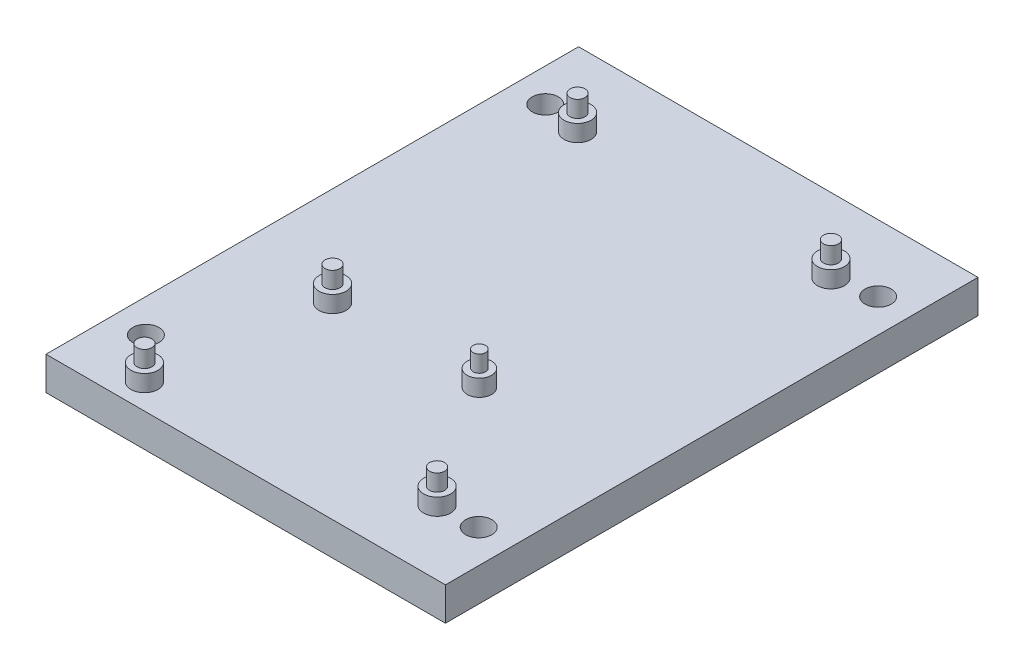
ISO-10303-21;
HEADER;
FILE_DESCRIPTION(('STEP AP214'),'2;1');
FILE_NAME('part.step','',(''),(''),'','','');
FILE_SCHEMA(('AUTOMOTIVE_DESIGN { 1 0 10303 214 1 1 1 1 }'));
ENDSEC;
DATA;
#1=APPLICATION_CONTEXT('core data for automotive mechanical design processes');
#2=APPLICATION_PROTOCOL_DEFINITION('international standard','automotive_design',2000,#1);
#3=PRODUCT_CONTEXT('',#1,'mechanical');
#4=PRODUCT('Part','Part','',(#3));
#5=PRODUCT_RELATED_PRODUCT_CATEGORY('part','',(#4));
#6=PRODUCT_DEFINITION_FORMATION('','',#4);
#7=PRODUCT_DEFINITION_CONTEXT('part definition',#1,'design');
#8=PRODUCT_DEFINITION('design','',#6,#7);
#9=PRODUCT_DEFINITION_SHAPE('','',#8);
#10=(LENGTH_UNIT() NAMED_UNIT(*) SI_UNIT(.MILLI.,.METRE.));
#11=(NAMED_UNIT(*) PLANE_ANGLE_UNIT() SI_UNIT($,.RADIAN.));
#12=(NAMED_UNIT(*) SI_UNIT($,.STERADIAN.) SOLID_ANGLE_UNIT());
#13=UNCERTAINTY_MEASURE_WITH_UNIT(LENGTH_MEASURE(1.E-05),#10,'distance_accuracy_value','');
#14=(GEOMETRIC_REPRESENTATION_CONTEXT(3) GLOBAL_UNCERTAINTY_ASSIGNED_CONTEXT((#13)) GLOBAL_UNIT_ASSIGNED_CONTEXT((#10,
#11,#12)) REPRESENTATION_CONTEXT('',''));
#15=CARTESIAN_POINT('',(0.,0.,0.));
#16=DIRECTION('',(0.,0.,1.));
#17=DIRECTION('',(1.,0.,0.));
#18=AXIS2_PLACEMENT_3D('',#15,#16,#17);
#19=CARTESIAN_POINT('',(0.,6.35,0.));
#20=DIRECTION('',(0.,-1.,0.));
#21=DIRECTION('',(0.,0.,-1.));
#22=AXIS2_PLACEMENT_3D('',#19,#20,#21);
#23=PLANE('',#22);
#24=CARTESIAN_POINT('',(24.1681,6.35,38.4556));
#25=DIRECTION('',(0.,-1.,0.));
#26=DIRECTION('',(0.,0.,-1.));
#27=AXIS2_PLACEMENT_3D('',#24,#25,#26);
#28=CIRCLE('',#27,2.5781);
#29=CARTESIAN_POINT('',(24.1681,6.35,35.8775));
#30=VERTEX_POINT('',#29);
#31=EDGE_CURVE('E46',#30,#30,#28,.F.);
#32=ORIENTED_EDGE('',*,*,#31,.F.);
#33=EDGE_LOOP('',(#32));
#34=FACE_BOUND('',#33,.T.);
#35=CARTESIAN_POINT('',(-24.1681,6.35,45.9486));
#36=DIRECTION('',(0.,-1.,0.));
#37=DIRECTION('',(0.,0.,-1.));
#38=AXIS2_PLACEMENT_3D('',#35,#36,#37);
#39=CIRCLE('',#38,2.5781);
#40=CARTESIAN_POINT('',(-24.1681,6.35,43.3705));
#41=VERTEX_POINT('',#40);
#42=EDGE_CURVE('E133',#41,#41,#39,.F.);
#43=ORIENTED_EDGE('',*,*,#42,.F.);
#44=EDGE_LOOP('',(#43));
#45=FACE_BOUND('',#44,.T.);
#46=CARTESIAN_POINT('',(8.72659276633327,6.35,14.9479));
#47=DIRECTION('',(0.,-1.,0.));
#48=DIRECTION('',(0.,0.,-1.));
#49=AXIS2_PLACEMENT_3D('',#46,#47,#48);
#50=CIRCLE('',#49,2.33125636337754);
#51=CARTESIAN_POINT('',(8.72659276633327,6.35,12.6166436366225));
#52=VERTEX_POINT('',#51);
#53=EDGE_CURVE('E131',#52,#52,#50,.F.);
#54=ORIENTED_EDGE('',*,*,#53,.F.);
#55=EDGE_LOOP('',(#54));
#56=FACE_BOUND('',#55,.T.);
#57=CARTESIAN_POINT('',(-19.2896072336667,6.35,14.9479));
#58=DIRECTION('',(0.,-1.,0.));
#59=DIRECTION('',(0.,0.,-1.));
#60=AXIS2_PLACEMENT_3D('',#57,#58,#59);
#61=CIRCLE('',#60,2.5781);
#62=CARTESIAN_POINT('',(-19.2896072336667,6.35,12.3698));
#63=VERTEX_POINT('',#62);
#64=EDGE_CURVE('E128',#63,#63,#61,.F.);
#65=ORIENTED_EDGE('',*,*,#64,.F.);
#66=EDGE_LOOP('',(#65));
#67=FACE_BOUND('',#66,.T.);
#68=CARTESIAN_POINT('',(24.1681,6.35,-36.6776));
#69=DIRECTION('',(0.,-1.,0.));
#70=DIRECTION('',(0.,0.,-1.));
#71=AXIS2_PLACEMENT_3D('',#68,#69,#70);
#72=CIRCLE('',#71,2.5781);
#73=CARTESIAN_POINT('',(24.1681,6.35,-39.2557));
#74=VERTEX_POINT('',#73);
#75=EDGE_CURVE('E125',#74,#74,#72,.F.);
#76=ORIENTED_EDGE('',*,*,#75,.F.);
#77=EDGE_LOOP('',(#76));
#78=FACE_BOUND('',#77,.T.);
#79=CARTESIAN_POINT('',(-24.1681,6.35,-36.6776));
#80=DIRECTION('',(0.,-1.,0.));
#81=DIRECTION('',(0.,0.,-1.));
#82=AXIS2_PLACEMENT_3D('',#79,#80,#81);
#83=CIRCLE('',#82,2.5781);
#84=CARTESIAN_POINT('',(-24.1681,6.35,-39.2557));
#85=VERTEX_POINT('',#84);
#86=EDGE_CURVE('E122',#85,#85,#83,.F.);
#87=ORIENTED_EDGE('',*,*,#86,.F.);
#88=EDGE_LOOP('',(#87));
#89=FACE_BOUND('',#88,.T.);
#90=DIRECTION('',(0.,0.,-1.));
#91=VECTOR('',#90,1.);
#92=CARTESIAN_POINT('',(38.1,6.35,50.8));
#93=LINE('',#92,#91);
#94=CARTESIAN_POINT('',(38.1,6.35,50.8));
#95=VERTEX_POINT('',#94);
#96=CARTESIAN_POINT('',(38.1,6.35,-50.8));
#97=VERTEX_POINT('',#96);
#98=EDGE_CURVE('E97',#95,#97,#93,.T.);
#99=ORIENTED_EDGE('',*,*,#98,.T.);
#100=DIRECTION('',(-1.,0.,0.));
#101=VECTOR('',#100,1.);
#102=CARTESIAN_POINT('',(-38.1,6.35,-50.8));
#103=LINE('',#102,#101);
#104=CARTESIAN_POINT('',(-38.1,6.35,-50.8));
#105=VERTEX_POINT('',#104);
#106=EDGE_CURVE('E92',#97,#105,#103,.T.);
#107=ORIENTED_EDGE('',*,*,#106,.T.);
#108=DIRECTION('',(0.,0.,1.));
#109=VECTOR('',#108,1.);
#110=CARTESIAN_POINT('',(-38.1,6.35,50.8));
#111=LINE('',#110,#109);
#112=CARTESIAN_POINT('',(-38.1,6.35,50.8));
#113=VERTEX_POINT('',#112);
#114=EDGE_CURVE('E95',#105,#113,#111,.T.);
#115=ORIENTED_EDGE('',*,*,#114,.T.);
#116=DIRECTION('',(1.,0.,0.));
#117=VECTOR('',#116,1.);
#118=CARTESIAN_POINT('',(-38.1,6.35,50.8));
#119=LINE('',#118,#117);
#120=EDGE_CURVE('E61',#113,#95,#119,.T.);
#121=ORIENTED_EDGE('',*,*,#120,.T.);
#122=EDGE_LOOP('',(#99,#107,#115,#121));
#123=FACE_BOUND('',#122,.T.);
#124=CARTESIAN_POINT('',(-31.75,6.35,-38.1));
#125=DIRECTION('',(0.,1.,0.));
#126=DIRECTION('',(0.,0.,1.));
#127=AXIS2_PLACEMENT_3D('',#124,#125,#126);
#128=CIRCLE('',#127,2.5);
#129=CARTESIAN_POINT('',(-31.75,6.35,-35.6));
#130=VERTEX_POINT('',#129);
#131=EDGE_CURVE('E115',#130,#130,#128,.T.);
#132=ORIENTED_EDGE('',*,*,#131,.F.);
#133=EDGE_LOOP('',(#132));
#134=FACE_BOUND('',#133,.T.);
#135=CARTESIAN_POINT('',(-31.75,6.35,38.1));
#136=DIRECTION('',(0.,1.,0.));
#137=DIRECTION('',(0.,0.,1.));
#138=AXIS2_PLACEMENT_3D('',#135,#136,#137);
#139=CIRCLE('',#138,2.5);
#140=CARTESIAN_POINT('',(-31.75,6.35,40.6));
#141=VERTEX_POINT('',#140);
#142=EDGE_CURVE('E183',#141,#141,#139,.T.);
#143=ORIENTED_EDGE('',*,*,#142,.F.);
#144=EDGE_LOOP('',(#143));
#145=FACE_BOUND('',#144,.T.);
#146=CARTESIAN_POINT('',(31.75,6.35,-38.1));
#147=DIRECTION('',(0.,1.,0.));
#148=DIRECTION('',(0.,0.,1.));
#149=AXIS2_PLACEMENT_3D('',#146,#147,#148);
#150=CIRCLE('',#149,2.5);
#151=CARTESIAN_POINT('',(31.75,6.35,-35.6));
#152=VERTEX_POINT('',#151);
#153=EDGE_CURVE('E177',#152,#152,#150,.T.);
#154=ORIENTED_EDGE('',*,*,#153,.F.);
#155=EDGE_LOOP('',(#154));
#156=FACE_BOUND('',#155,.T.);
#157=CARTESIAN_POINT('',(31.75,6.35,38.1));
#158=DIRECTION('',(0.,1.,0.));
#159=DIRECTION('',(0.,0.,1.));
#160=AXIS2_PLACEMENT_3D('',#157,#158,#159);
#161=CIRCLE('',#160,2.5);
#162=CARTESIAN_POINT('',(31.75,6.35,40.6));
#163=VERTEX_POINT('',#162);
#164=EDGE_CURVE('E171',#163,#163,#161,.T.);
#165=ORIENTED_EDGE('',*,*,#164,.F.);
#166=EDGE_LOOP('',(#165));
#167=FACE_BOUND('',#166,.T.);
#168=ADVANCED_FACE('F42',(#34,#45,#56,#67,#78,#89,#123,#134,#145,#156,#167),#23,.F.);
#169=CARTESIAN_POINT('',(0.,0.,0.));
#170=DIRECTION('',(0.,-1.,0.));
#171=DIRECTION('',(0.,0.,-1.));
#172=AXIS2_PLACEMENT_3D('',#169,#170,#171);
#173=PLANE('',#172);
#174=CARTESIAN_POINT('',(31.75,0.,-38.1));
#175=DIRECTION('',(0.,1.,0.));
#176=DIRECTION('',(0.,0.,1.));
#177=AXIS2_PLACEMENT_3D('',#174,#175,#176);
#178=CIRCLE('',#177,2.5);
#179=CARTESIAN_POINT('',(31.75,0.,-35.6));
#180=VERTEX_POINT('',#179);
#181=EDGE_CURVE('E174',#180,#180,#178,.T.);
#182=ORIENTED_EDGE('',*,*,#181,.T.);
#183=EDGE_LOOP('',(#182));
#184=FACE_BOUND('',#183,.T.);
#185=CARTESIAN_POINT('',(-31.75,0.,-38.1));
#186=DIRECTION('',(0.,1.,0.));
#187=DIRECTION('',(0.,0.,1.));
#188=AXIS2_PLACEMENT_3D('',#185,#186,#187);
#189=CIRCLE('',#188,2.5);
#190=CARTESIAN_POINT('',(-31.75,0.,-35.6));
#191=VERTEX_POINT('',#190);
#192=EDGE_CURVE('E186',#191,#191,#189,.T.);
#193=ORIENTED_EDGE('',*,*,#192,.T.);
#194=EDGE_LOOP('',(#193));
#195=FACE_BOUND('',#194,.T.);
#196=DIRECTION('',(0.,0.,-1.));
#197=VECTOR('',#196,1.);
#198=CARTESIAN_POINT('',(38.1,0.,50.8));
#199=LINE('',#198,#197);
#200=CARTESIAN_POINT('',(38.1,0.,50.8));
#201=VERTEX_POINT('',#200);
#202=CARTESIAN_POINT('',(38.1,0.,-50.8));
#203=VERTEX_POINT('',#202);
#204=EDGE_CURVE('E112',#201,#203,#199,.T.);
#205=ORIENTED_EDGE('',*,*,#204,.F.);
#206=DIRECTION('',(1.,0.,0.));
#207=VECTOR('',#206,1.);
#208=CARTESIAN_POINT('',(-38.1,0.,50.8));
#209=LINE('',#208,#207);
#210=CARTESIAN_POINT('',(-38.1,0.,50.8));
#211=VERTEX_POINT('',#210);
#212=EDGE_CURVE('E84',#211,#201,#209,.T.);
#213=ORIENTED_EDGE('',*,*,#212,.F.);
#214=DIRECTION('',(0.,0.,1.));
#215=VECTOR('',#214,1.);
#216=CARTESIAN_POINT('',(-38.1,0.,50.8));
#217=LINE('',#216,#215);
#218=CARTESIAN_POINT('',(-38.1,0.,-50.8));
#219=VERTEX_POINT('',#218);
#220=EDGE_CURVE('E78',#219,#211,#217,.T.);
#221=ORIENTED_EDGE('',*,*,#220,.F.);
#222=DIRECTION('',(-1.,0.,0.));
#223=VECTOR('',#222,1.);
#224=CARTESIAN_POINT('',(-38.1,0.,-50.8));
#225=LINE('',#224,#223);
#226=EDGE_CURVE('E102',#203,#219,#225,.T.);
#227=ORIENTED_EDGE('',*,*,#226,.F.);
#228=EDGE_LOOP('',(#205,#213,#221,#227));
#229=FACE_BOUND('',#228,.T.);
#230=CARTESIAN_POINT('',(-31.75,0.,38.1));
#231=DIRECTION('',(0.,1.,0.));
#232=DIRECTION('',(0.,0.,1.));
#233=AXIS2_PLACEMENT_3D('',#230,#231,#232);
#234=CIRCLE('',#233,2.5);
#235=CARTESIAN_POINT('',(-31.75,0.,40.6));
#236=VERTEX_POINT('',#235);
#237=EDGE_CURVE('E180',#236,#236,#234,.T.);
#238=ORIENTED_EDGE('',*,*,#237,.T.);
#239=EDGE_LOOP('',(#238));
#240=FACE_BOUND('',#239,.T.);
#241=CARTESIAN_POINT('',(31.75,0.,38.1));
#242=DIRECTION('',(0.,1.,0.));
#243=DIRECTION('',(0.,0.,1.));
#244=AXIS2_PLACEMENT_3D('',#241,#242,#243);
#245=CIRCLE('',#244,2.5);
#246=CARTESIAN_POINT('',(31.75,0.,40.6));
#247=VERTEX_POINT('',#246);
#248=EDGE_CURVE('E170',#247,#247,#245,.T.);
#249=ORIENTED_EDGE('',*,*,#248,.T.);
#250=EDGE_LOOP('',(#249));
#251=FACE_BOUND('',#250,.T.);
#252=ADVANCED_FACE('F194',(#184,#195,#229,#240,#251),#173,.T.);
#253=CARTESIAN_POINT('',(38.1,6.35,50.8));
#254=DIRECTION('',(-1.,0.,0.));
#255=DIRECTION('',(0.,0.,1.));
#256=AXIS2_PLACEMENT_3D('',#253,#254,#255);
#257=PLANE('',#256);
#258=ORIENTED_EDGE('',*,*,#204,.T.);
#259=DIRECTION('',(0.,-1.,0.));
#260=VECTOR('',#259,1.);
#261=CARTESIAN_POINT('',(38.1,6.35,-50.8));
#262=LINE('',#261,#260);
#263=EDGE_CURVE('E103',#97,#203,#262,.T.);
#264=ORIENTED_EDGE('',*,*,#263,.F.);
#265=ORIENTED_EDGE('',*,*,#98,.F.);
#266=DIRECTION('',(0.,-1.,0.));
#267=VECTOR('',#266,1.);
#268=CARTESIAN_POINT('',(38.1,6.35,50.8));
#269=LINE('',#268,#267);
#270=EDGE_CURVE('E108',#95,#201,#269,.T.);
#271=ORIENTED_EDGE('',*,*,#270,.T.);
#272=EDGE_LOOP('',(#258,#264,#265,#271));
#273=FACE_BOUND('',#272,.T.);
#274=ADVANCED_FACE('F44',(#273),#257,.F.);
#275=CARTESIAN_POINT('',(-38.1,6.35,-50.8));
#276=DIRECTION('',(0.,0.,1.));
#277=DIRECTION('',(1.,0.,0.));
#278=AXIS2_PLACEMENT_3D('',#275,#276,#277);
#279=PLANE('',#278);
#280=ORIENTED_EDGE('',*,*,#226,.T.);
#281=DIRECTION('',(0.,-1.,0.));
#282=VECTOR('',#281,1.);
#283=CARTESIAN_POINT('',(-38.1,6.35,-50.8));
#284=LINE('',#283,#282);
#285=EDGE_CURVE('E100',#105,#219,#284,.T.);
#286=ORIENTED_EDGE('',*,*,#285,.F.);
#287=ORIENTED_EDGE('',*,*,#106,.F.);
#288=ORIENTED_EDGE('',*,*,#263,.T.);
#289=EDGE_LOOP('',(#280,#286,#287,#288));
#290=FACE_BOUND('',#289,.T.);
#291=ADVANCED_FACE('F101',(#290),#279,.F.);
#292=CARTESIAN_POINT('',(-38.1,6.35,50.8));
#293=DIRECTION('',(1.,0.,0.));
#294=DIRECTION('',(0.,0.,-1.));
#295=AXIS2_PLACEMENT_3D('',#292,#293,#294);
#296=PLANE('',#295);
#297=ORIENTED_EDGE('',*,*,#220,.T.);
#298=DIRECTION('',(0.,-1.,0.));
#299=VECTOR('',#298,1.);
#300=CARTESIAN_POINT('',(-38.1,6.35,50.8));
#301=LINE('',#300,#299);
#302=EDGE_CURVE('E104',#113,#211,#301,.T.);
#303=ORIENTED_EDGE('',*,*,#302,.F.);
#304=ORIENTED_EDGE('',*,*,#114,.F.);
#305=ORIENTED_EDGE('',*,*,#285,.T.);
#306=EDGE_LOOP('',(#297,#303,#304,#305));
#307=FACE_BOUND('',#306,.T.);
#308=ADVANCED_FACE('F106',(#307),#296,.F.);
#309=CARTESIAN_POINT('',(-38.1,6.35,50.8));
#310=DIRECTION('',(0.,0.,-1.));
#311=DIRECTION('',(-1.,0.,0.));
#312=AXIS2_PLACEMENT_3D('',#309,#310,#311);
#313=PLANE('',#312);
#314=ORIENTED_EDGE('',*,*,#212,.T.);
#315=ORIENTED_EDGE('',*,*,#270,.F.);
#316=ORIENTED_EDGE('',*,*,#120,.F.);
#317=ORIENTED_EDGE('',*,*,#302,.T.);
#318=EDGE_LOOP('',(#314,#315,#316,#317));
#319=FACE_BOUND('',#318,.T.);
#320=ADVANCED_FACE('F200',(#319),#313,.F.);
#321=CARTESIAN_POINT('',(-31.75,6.35,-38.1));
#322=DIRECTION('',(0.,-1.,0.));
#323=DIRECTION('',(0.,0.,-1.));
#324=AXIS2_PLACEMENT_3D('',#321,#322,#323);
#325=CYLINDRICAL_SURFACE('',#324,2.5);
#326=ORIENTED_EDGE('',*,*,#131,.T.);
#327=EDGE_LOOP('',(#326));
#328=FACE_BOUND('',#327,.T.);
#329=ORIENTED_EDGE('',*,*,#192,.F.);
#330=EDGE_LOOP('',(#329));
#331=FACE_BOUND('',#330,.T.);
#332=ADVANCED_FACE('F197',(#328,#331),#325,.F.);
#333=CARTESIAN_POINT('',(-31.75,6.35,38.1));
#334=DIRECTION('',(0.,-1.,0.));
#335=DIRECTION('',(0.,0.,-1.));
#336=AXIS2_PLACEMENT_3D('',#333,#334,#335);
#337=CYLINDRICAL_SURFACE('',#336,2.5);
#338=ORIENTED_EDGE('',*,*,#142,.T.);
#339=EDGE_LOOP('',(#338));
#340=FACE_BOUND('',#339,.T.);
#341=ORIENTED_EDGE('',*,*,#237,.F.);
#342=EDGE_LOOP('',(#341));
#343=FACE_BOUND('',#342,.T.);
#344=ADVANCED_FACE('F199',(#340,#343),#337,.F.);
#345=CARTESIAN_POINT('',(31.75,6.35,-38.1));
#346=DIRECTION('',(0.,-1.,0.));
#347=DIRECTION('',(0.,0.,-1.));
#348=AXIS2_PLACEMENT_3D('',#345,#346,#347);
#349=CYLINDRICAL_SURFACE('',#348,2.5);
#350=ORIENTED_EDGE('',*,*,#153,.T.);
#351=EDGE_LOOP('',(#350));
#352=FACE_BOUND('',#351,.T.);
#353=ORIENTED_EDGE('',*,*,#181,.F.);
#354=EDGE_LOOP('',(#353));
#355=FACE_BOUND('',#354,.T.);
#356=ADVANCED_FACE('F207',(#352,#355),#349,.F.);
#357=CARTESIAN_POINT('',(31.75,6.35,38.1));
#358=DIRECTION('',(0.,-1.,0.));
#359=DIRECTION('',(0.,0.,-1.));
#360=AXIS2_PLACEMENT_3D('',#357,#358,#359);
#361=CYLINDRICAL_SURFACE('',#360,2.5);
#362=ORIENTED_EDGE('',*,*,#164,.T.);
#363=EDGE_LOOP('',(#362));
#364=FACE_BOUND('',#363,.T.);
#365=ORIENTED_EDGE('',*,*,#248,.F.);
#366=EDGE_LOOP('',(#365));
#367=FACE_BOUND('',#366,.T.);
#368=ADVANCED_FACE('F235',(#364,#367),#361,.F.);
#369=CARTESIAN_POINT('',(-24.1681,9.525,-36.6776));
#370=DIRECTION('',(0.,-1.,0.));
#371=DIRECTION('',(0.,0.,-1.));
#372=AXIS2_PLACEMENT_3D('',#369,#370,#371);
#373=CYLINDRICAL_SURFACE('',#372,2.5781);
#374=CARTESIAN_POINT('',(-24.1681,9.525,-36.6776));
#375=DIRECTION('',(0.,1.,0.));
#376=DIRECTION('',(0.,0.,1.));
#377=AXIS2_PLACEMENT_3D('',#374,#375,#376);
#378=CIRCLE('',#377,2.5781);
#379=CARTESIAN_POINT('',(-24.1681,9.525,-34.0995));
#380=VERTEX_POINT('',#379);
#381=EDGE_CURVE('E167',#380,#380,#378,.T.);
#382=ORIENTED_EDGE('',*,*,#381,.F.);
#383=EDGE_LOOP('',(#382));
#384=FACE_BOUND('',#383,.T.);
#385=ORIENTED_EDGE('',*,*,#86,.T.);
#386=EDGE_LOOP('',(#385));
#387=FACE_BOUND('',#386,.T.);
#388=ADVANCED_FACE('F237',(#384,#387),#373,.T.);
#389=CARTESIAN_POINT('',(0.,9.525,0.));
#390=DIRECTION('',(0.,1.,0.));
#391=DIRECTION('',(0.,0.,1.));
#392=AXIS2_PLACEMENT_3D('',#389,#390,#391);
#393=PLANE('',#392);
#394=CARTESIAN_POINT('',(-24.1681,9.525,-36.6776));
#395=DIRECTION('',(0.,1.,0.));
#396=DIRECTION('',(0.,0.,1.));
#397=AXIS2_PLACEMENT_3D('',#394,#395,#396);
#398=CIRCLE('',#397,1.43509999999999);
#399=CARTESIAN_POINT('',(-24.1681,9.525,-35.2425));
#400=VERTEX_POINT('',#399);
#401=EDGE_CURVE('E138',#400,#400,#398,.T.);
#402=ORIENTED_EDGE('',*,*,#401,.F.);
#403=EDGE_LOOP('',(#402));
#404=FACE_BOUND('',#403,.T.);
#405=ORIENTED_EDGE('',*,*,#381,.T.);
#406=EDGE_LOOP('',(#405));
#407=FACE_BOUND('',#406,.T.);
#408=ADVANCED_FACE('F244',(#404,#407),#393,.T.);
#409=CARTESIAN_POINT('',(24.1681,9.525,-36.6776));
#410=DIRECTION('',(0.,-1.,0.));
#411=DIRECTION('',(0.,0.,-1.));
#412=AXIS2_PLACEMENT_3D('',#409,#410,#411);
#413=CYLINDRICAL_SURFACE('',#412,2.5781);
#414=CARTESIAN_POINT('',(24.1681,9.525,-36.6776));
#415=DIRECTION('',(0.,1.,0.));
#416=DIRECTION('',(0.,0.,1.));
#417=AXIS2_PLACEMENT_3D('',#414,#415,#416);
#418=CIRCLE('',#417,2.5781);
#419=CARTESIAN_POINT('',(24.1681,9.525,-34.0995));
#420=VERTEX_POINT('',#419);
#421=EDGE_CURVE('E164',#420,#420,#418,.T.);
#422=ORIENTED_EDGE('',*,*,#421,.F.);
#423=EDGE_LOOP('',(#422));
#424=FACE_BOUND('',#423,.T.);
#425=ORIENTED_EDGE('',*,*,#75,.T.);
#426=EDGE_LOOP('',(#425));
#427=FACE_BOUND('',#426,.T.);
#428=ADVANCED_FACE('F252',(#424,#427),#413,.T.);
#429=CARTESIAN_POINT('',(0.,9.525,0.));
#430=DIRECTION('',(0.,1.,0.));
#431=DIRECTION('',(0.,0.,1.));
#432=AXIS2_PLACEMENT_3D('',#429,#430,#431);
#433=PLANE('',#432);
#434=CARTESIAN_POINT('',(24.1681,9.525,-36.6776));
#435=DIRECTION('',(0.,1.,0.));
#436=DIRECTION('',(0.,0.,1.));
#437=AXIS2_PLACEMENT_3D('',#434,#435,#436);
#438=CIRCLE('',#437,1.43509999999999);
#439=CARTESIAN_POINT('',(24.1681,9.525,-35.2425));
#440=VERTEX_POINT('',#439);
#441=EDGE_CURVE('E142',#440,#440,#438,.T.);
#442=ORIENTED_EDGE('',*,*,#441,.F.);
#443=EDGE_LOOP('',(#442));
#444=FACE_BOUND('',#443,.T.);
#445=ORIENTED_EDGE('',*,*,#421,.T.);
#446=EDGE_LOOP('',(#445));
#447=FACE_BOUND('',#446,.T.);
#448=ADVANCED_FACE('F256',(#444,#447),#433,.T.);
#449=CARTESIAN_POINT('',(-19.2896072336667,9.525,14.9479));
#450=DIRECTION('',(0.,-1.,0.));
#451=DIRECTION('',(0.,0.,-1.));
#452=AXIS2_PLACEMENT_3D('',#449,#450,#451);
#453=CYLINDRICAL_SURFACE('',#452,2.5781);
#454=CARTESIAN_POINT('',(-19.2896072336667,9.525,14.9479));
#455=DIRECTION('',(0.,1.,0.));
#456=DIRECTION('',(0.,0.,1.));
#457=AXIS2_PLACEMENT_3D('',#454,#455,#456);
#458=CIRCLE('',#457,2.5781);
#459=CARTESIAN_POINT('',(-19.2896072336667,9.525,17.526));
#460=VERTEX_POINT('',#459);
#461=EDGE_CURVE('E161',#460,#460,#458,.T.);
#462=ORIENTED_EDGE('',*,*,#461,.F.);
#463=EDGE_LOOP('',(#462));
#464=FACE_BOUND('',#463,.T.);
#465=ORIENTED_EDGE('',*,*,#64,.T.);
#466=EDGE_LOOP('',(#465));
#467=FACE_BOUND('',#466,.T.);
#468=ADVANCED_FACE('F260',(#464,#467),#453,.T.);
#469=CARTESIAN_POINT('',(0.,9.525,0.));
#470=DIRECTION('',(0.,1.,0.));
#471=DIRECTION('',(0.,0.,1.));
#472=AXIS2_PLACEMENT_3D('',#469,#470,#471);
#473=PLANE('',#472);
#474=CARTESIAN_POINT('',(-19.2896072336667,9.525,14.9479));
#475=DIRECTION('',(0.,1.,0.));
#476=DIRECTION('',(0.,0.,1.));
#477=AXIS2_PLACEMENT_3D('',#474,#475,#476);
#478=CIRCLE('',#477,1.4351);
#479=CARTESIAN_POINT('',(-19.2896072336667,9.525,16.383));
#480=VERTEX_POINT('',#479);
#481=EDGE_CURVE('E147',#480,#480,#478,.T.);
#482=ORIENTED_EDGE('',*,*,#481,.F.);
#483=EDGE_LOOP('',(#482));
#484=FACE_BOUND('',#483,.T.);
#485=ORIENTED_EDGE('',*,*,#461,.T.);
#486=EDGE_LOOP('',(#485));
#487=FACE_BOUND('',#486,.T.);
#488=ADVANCED_FACE('F264',(#484,#487),#473,.T.);
#489=CARTESIAN_POINT('',(8.72659276633327,9.525,14.9479));
#490=DIRECTION('',(0.,-1.,0.));
#491=DIRECTION('',(0.,0.,-1.));
#492=AXIS2_PLACEMENT_3D('',#489,#490,#491);
#493=CYLINDRICAL_SURFACE('',#492,2.33125636337754);
#494=CARTESIAN_POINT('',(8.72659276633327,9.525,14.9479));
#495=DIRECTION('',(0.,1.,0.));
#496=DIRECTION('',(0.,0.,1.));
#497=AXIS2_PLACEMENT_3D('',#494,#495,#496);
#498=CIRCLE('',#497,2.33125636337754);
#499=CARTESIAN_POINT('',(8.72659276633327,9.525,17.2791563633775));
#500=VERTEX_POINT('',#499);
#501=EDGE_CURVE('E158',#500,#500,#498,.T.);
#502=ORIENTED_EDGE('',*,*,#501,.F.);
#503=EDGE_LOOP('',(#502));
#504=FACE_BOUND('',#503,.T.);
#505=ORIENTED_EDGE('',*,*,#53,.T.);
#506=EDGE_LOOP('',(#505));
#507=FACE_BOUND('',#506,.T.);
#508=ADVANCED_FACE('F268',(#504,#507),#493,.T.);
#509=CARTESIAN_POINT('',(0.,9.525,0.));
#510=DIRECTION('',(0.,1.,0.));
#511=DIRECTION('',(0.,0.,1.));
#512=AXIS2_PLACEMENT_3D('',#509,#510,#511);
#513=PLANE('',#512);
#514=CARTESIAN_POINT('',(8.72659276633327,9.525,14.9479));
#515=DIRECTION('',(0.,1.,0.));
#516=DIRECTION('',(0.,0.,1.));
#517=AXIS2_PLACEMENT_3D('',#514,#515,#516);
#518=CIRCLE('',#517,1.18825636337754);
#519=CARTESIAN_POINT('',(8.72659276633327,9.525,16.1361563633775));
#520=VERTEX_POINT('',#519);
#521=EDGE_CURVE('E353',#520,#520,#518,.T.);
#522=ORIENTED_EDGE('',*,*,#521,.F.);
#523=EDGE_LOOP('',(#522));
#524=FACE_BOUND('',#523,.T.);
#525=ORIENTED_EDGE('',*,*,#501,.T.);
#526=EDGE_LOOP('',(#525));
#527=FACE_BOUND('',#526,.T.);
#528=ADVANCED_FACE('F272',(#524,#527),#513,.T.);
#529=CARTESIAN_POINT('',(-24.1681,9.525,45.9486));
#530=DIRECTION('',(0.,-1.,0.));
#531=DIRECTION('',(0.,0.,-1.));
#532=AXIS2_PLACEMENT_3D('',#529,#530,#531);
#533=CYLINDRICAL_SURFACE('',#532,2.5781);
#534=CARTESIAN_POINT('',(-24.1681,9.525,45.9486));
#535=DIRECTION('',(0.,1.,0.));
#536=DIRECTION('',(0.,0.,1.));
#537=AXIS2_PLACEMENT_3D('',#534,#535,#536);
#538=CIRCLE('',#537,2.5781);
#539=CARTESIAN_POINT('',(-24.1681,9.525,48.5267));
#540=VERTEX_POINT('',#539);
#541=EDGE_CURVE('E155',#540,#540,#538,.T.);
#542=ORIENTED_EDGE('',*,*,#541,.F.);
#543=EDGE_LOOP('',(#542));
#544=FACE_BOUND('',#543,.T.);
#545=ORIENTED_EDGE('',*,*,#42,.T.);
#546=EDGE_LOOP('',(#545));
#547=FACE_BOUND('',#546,.T.);
#548=ADVANCED_FACE('F276',(#544,#547),#533,.T.);
#549=CARTESIAN_POINT('',(0.,9.525,0.));
#550=DIRECTION('',(0.,1.,0.));
#551=DIRECTION('',(0.,0.,1.));
#552=AXIS2_PLACEMENT_3D('',#549,#550,#551);
#553=PLANE('',#552);
#554=CARTESIAN_POINT('',(-24.1681,9.525,45.9486));
#555=DIRECTION('',(0.,1.,0.));
#556=DIRECTION('',(0.,0.,1.));
#557=AXIS2_PLACEMENT_3D('',#554,#555,#556);
#558=CIRCLE('',#557,1.43509999999999);
#559=CARTESIAN_POINT('',(-24.1681,9.525,47.3837));
#560=VERTEX_POINT('',#559);
#561=EDGE_CURVE('E11',#560,#560,#558,.T.);
#562=ORIENTED_EDGE('',*,*,#561,.F.);
#563=EDGE_LOOP('',(#562));
#564=FACE_BOUND('',#563,.T.);
#565=ORIENTED_EDGE('',*,*,#541,.T.);
#566=EDGE_LOOP('',(#565));
#567=FACE_BOUND('',#566,.T.);
#568=ADVANCED_FACE('F280',(#564,#567),#553,.T.);
#569=CARTESIAN_POINT('',(24.1681,9.525,38.4556));
#570=DIRECTION('',(0.,-1.,0.));
#571=DIRECTION('',(0.,0.,-1.));
#572=AXIS2_PLACEMENT_3D('',#569,#570,#571);
#573=CYLINDRICAL_SURFACE('',#572,2.5781);
#574=CARTESIAN_POINT('',(24.1681,9.525,38.4556));
#575=DIRECTION('',(0.,1.,0.));
#576=DIRECTION('',(0.,0.,1.));
#577=AXIS2_PLACEMENT_3D('',#574,#575,#576);
#578=CIRCLE('',#577,2.5781);
#579=CARTESIAN_POINT('',(24.1681,9.525,41.0337));
#580=VERTEX_POINT('',#579);
#581=EDGE_CURVE('E152',#580,#580,#578,.T.);
#582=ORIENTED_EDGE('',*,*,#581,.F.);
#583=EDGE_LOOP('',(#582));
#584=FACE_BOUND('',#583,.T.);
#585=ORIENTED_EDGE('',*,*,#31,.T.);
#586=EDGE_LOOP('',(#585));
#587=FACE_BOUND('',#586,.T.);
#588=ADVANCED_FACE('F284',(#584,#587),#573,.T.);
#589=CARTESIAN_POINT('',(0.,9.525,0.));
#590=DIRECTION('',(0.,1.,0.));
#591=DIRECTION('',(0.,0.,1.));
#592=AXIS2_PLACEMENT_3D('',#589,#590,#591);
#593=PLANE('',#592);
#594=CARTESIAN_POINT('',(24.1681,9.525,38.4556));
#595=DIRECTION('',(0.,1.,0.));
#596=DIRECTION('',(0.,0.,1.));
#597=AXIS2_PLACEMENT_3D('',#594,#595,#596);
#598=CIRCLE('',#597,1.43509999999999);
#599=CARTESIAN_POINT('',(24.1681,9.525,39.8907));
#600=VERTEX_POINT('',#599);
#601=EDGE_CURVE('E52',#600,#600,#598,.T.);
#602=ORIENTED_EDGE('',*,*,#601,.F.);
#603=EDGE_LOOP('',(#602));
#604=FACE_BOUND('',#603,.T.);
#605=ORIENTED_EDGE('',*,*,#581,.T.);
#606=EDGE_LOOP('',(#605));
#607=FACE_BOUND('',#606,.T.);
#608=ADVANCED_FACE('F288',(#604,#607),#593,.T.);
#609=CARTESIAN_POINT('',(-24.1681,12.7,-36.6776));
#610=DIRECTION('',(0.,-1.,0.));
#611=DIRECTION('',(0.,0.,-1.));
#612=AXIS2_PLACEMENT_3D('',#609,#610,#611);
#613=CYLINDRICAL_SURFACE('',#612,1.43509999999999);
#614=CARTESIAN_POINT('',(-24.1681,12.7,-36.6776));
#615=DIRECTION('',(0.,1.,0.));
#616=DIRECTION('',(0.,0.,1.));
#617=AXIS2_PLACEMENT_3D('',#614,#615,#616);
#618=CIRCLE('',#617,1.43509999999999);
#619=CARTESIAN_POINT('',(-24.1681,12.7,-35.2425));
#620=VERTEX_POINT('',#619);
#621=EDGE_CURVE('E151',#620,#620,#618,.T.);
#622=ORIENTED_EDGE('',*,*,#621,.F.);
#623=EDGE_LOOP('',(#622));
#624=FACE_BOUND('',#623,.T.);
#625=ORIENTED_EDGE('',*,*,#401,.T.);
#626=EDGE_LOOP('',(#625));
#627=FACE_BOUND('',#626,.T.);
#628=ADVANCED_FACE('F292',(#624,#627),#613,.T.);
#629=CARTESIAN_POINT('',(-24.1681,12.7,-36.6776));
#630=DIRECTION('',(0.,1.,0.));
#631=DIRECTION('',(0.,0.,1.));
#632=AXIS2_PLACEMENT_3D('',#629,#630,#631);
#633=PLANE('',#632);
#634=ORIENTED_EDGE('',*,*,#621,.T.);
#635=EDGE_LOOP('',(#634));
#636=FACE_BOUND('',#635,.T.);
#637=ADVANCED_FACE('F296',(#636),#633,.T.);
#638=CARTESIAN_POINT('',(24.1681,12.7,-36.6776));
#639=DIRECTION('',(0.,-1.,0.));
#640=DIRECTION('',(0.,0.,-1.));
#641=AXIS2_PLACEMENT_3D('',#638,#639,#640);
#642=CYLINDRICAL_SURFACE('',#641,1.43509999999999);
#643=CARTESIAN_POINT('',(24.1681,12.7,-36.6776));
#644=DIRECTION('',(0.,1.,0.));
#645=DIRECTION('',(0.,0.,1.));
#646=AXIS2_PLACEMENT_3D('',#643,#644,#645);
#647=CIRCLE('',#646,1.43509999999999);
#648=CARTESIAN_POINT('',(24.1681,12.7,-35.2425));
#649=VERTEX_POINT('',#648);
#650=EDGE_CURVE('E361',#649,#649,#647,.T.);
#651=ORIENTED_EDGE('',*,*,#650,.F.);
#652=EDGE_LOOP('',(#651));
#653=FACE_BOUND('',#652,.T.);
#654=ORIENTED_EDGE('',*,*,#441,.T.);
#655=EDGE_LOOP('',(#654));
#656=FACE_BOUND('',#655,.T.);
#657=ADVANCED_FACE('F300',(#653,#656),#642,.T.);
#658=CARTESIAN_POINT('',(24.1681,12.7,-36.6776));
#659=DIRECTION('',(0.,1.,0.));
#660=DIRECTION('',(0.,0.,1.));
#661=AXIS2_PLACEMENT_3D('',#658,#659,#660);
#662=PLANE('',#661);
#663=ORIENTED_EDGE('',*,*,#650,.T.);
#664=EDGE_LOOP('',(#663));
#665=FACE_BOUND('',#664,.T.);
#666=ADVANCED_FACE('F304',(#665),#662,.T.);
#667=CARTESIAN_POINT('',(-19.2896072336667,12.7,14.9479));
#668=DIRECTION('',(0.,-1.,0.));
#669=DIRECTION('',(0.,0.,-1.));
#670=AXIS2_PLACEMENT_3D('',#667,#668,#669);
#671=CYLINDRICAL_SURFACE('',#670,1.4351);
#672=CARTESIAN_POINT('',(-19.2896072336667,12.7,14.9479));
#673=DIRECTION('',(0.,1.,0.));
#674=DIRECTION('',(0.,0.,1.));
#675=AXIS2_PLACEMENT_3D('',#672,#673,#674);
#676=CIRCLE('',#675,1.4351);
#677=CARTESIAN_POINT('',(-19.2896072336667,12.7,16.383));
#678=VERTEX_POINT('',#677);
#679=EDGE_CURVE('E356',#678,#678,#676,.T.);
#680=ORIENTED_EDGE('',*,*,#679,.F.);
#681=EDGE_LOOP('',(#680));
#682=FACE_BOUND('',#681,.T.);
#683=ORIENTED_EDGE('',*,*,#481,.T.);
#684=EDGE_LOOP('',(#683));
#685=FACE_BOUND('',#684,.T.);
#686=ADVANCED_FACE('F308',(#682,#685),#671,.T.);
#687=CARTESIAN_POINT('',(-19.2896072336667,12.7,14.9479));
#688=DIRECTION('',(0.,1.,0.));
#689=DIRECTION('',(0.,0.,1.));
#690=AXIS2_PLACEMENT_3D('',#687,#688,#689);
#691=PLANE('',#690);
#692=ORIENTED_EDGE('',*,*,#679,.T.);
#693=EDGE_LOOP('',(#692));
#694=FACE_BOUND('',#693,.T.);
#695=ADVANCED_FACE('F312',(#694),#691,.T.);
#696=CARTESIAN_POINT('',(8.72659276633327,12.7,14.9479));
#697=DIRECTION('',(0.,-1.,0.));
#698=DIRECTION('',(0.,0.,-1.));
#699=AXIS2_PLACEMENT_3D('',#696,#697,#698);
#700=CYLINDRICAL_SURFACE('',#699,1.18825636337754);
#701=CARTESIAN_POINT('',(8.72659276633327,12.7,14.9479));
#702=DIRECTION('',(0.,1.,0.));
#703=DIRECTION('',(0.,0.,1.));
#704=AXIS2_PLACEMENT_3D('',#701,#702,#703);
#705=CIRCLE('',#704,1.18825636337754);
#706=CARTESIAN_POINT('',(8.72659276633327,12.7,16.1361563633775));
#707=VERTEX_POINT('',#706);
#708=EDGE_CURVE('E348',#707,#707,#705,.T.);
#709=ORIENTED_EDGE('',*,*,#708,.F.);
#710=EDGE_LOOP('',(#709));
#711=FACE_BOUND('',#710,.T.);
#712=ORIENTED_EDGE('',*,*,#521,.T.);
#713=EDGE_LOOP('',(#712));
#714=FACE_BOUND('',#713,.T.);
#715=ADVANCED_FACE('F316',(#711,#714),#700,.T.);
#716=CARTESIAN_POINT('',(8.72659276633327,12.7,14.9479));
#717=DIRECTION('',(0.,1.,0.));
#718=DIRECTION('',(0.,0.,1.));
#719=AXIS2_PLACEMENT_3D('',#716,#717,#718);
#720=PLANE('',#719);
#721=ORIENTED_EDGE('',*,*,#708,.T.);
#722=EDGE_LOOP('',(#721));
#723=FACE_BOUND('',#722,.T.);
#724=ADVANCED_FACE('F320',(#723),#720,.T.);
#725=CARTESIAN_POINT('',(24.1681,12.7,38.4556));
#726=DIRECTION('',(0.,-1.,0.));
#727=DIRECTION('',(0.,0.,-1.));
#728=AXIS2_PLACEMENT_3D('',#725,#726,#727);
#729=CYLINDRICAL_SURFACE('',#728,1.43509999999999);
#730=CARTESIAN_POINT('',(24.1681,12.7,38.4556));
#731=DIRECTION('',(0.,1.,0.));
#732=DIRECTION('',(0.,0.,1.));
#733=AXIS2_PLACEMENT_3D('',#730,#731,#732);
#734=CIRCLE('',#733,1.43509999999999);
#735=CARTESIAN_POINT('',(24.1681,12.7,39.8907));
#736=VERTEX_POINT('',#735);
#737=EDGE_CURVE('E345',#736,#736,#734,.T.);
#738=ORIENTED_EDGE('',*,*,#737,.F.);
#739=EDGE_LOOP('',(#738));
#740=FACE_BOUND('',#739,.T.);
#741=ORIENTED_EDGE('',*,*,#601,.T.);
#742=EDGE_LOOP('',(#741));
#743=FACE_BOUND('',#742,.T.);
#744=ADVANCED_FACE('F324',(#740,#743),#729,.T.);
#745=CARTESIAN_POINT('',(24.1681,12.7,38.4556));
#746=DIRECTION('',(0.,1.,0.));
#747=DIRECTION('',(0.,0.,1.));
#748=AXIS2_PLACEMENT_3D('',#745,#746,#747);
#749=PLANE('',#748);
#750=ORIENTED_EDGE('',*,*,#737,.T.);
#751=EDGE_LOOP('',(#750));
#752=FACE_BOUND('',#751,.T.);
#753=ADVANCED_FACE('F328',(#752),#749,.T.);
#754=CARTESIAN_POINT('',(-24.1681,12.7,45.9486));
#755=DIRECTION('',(0.,-1.,0.));
#756=DIRECTION('',(0.,0.,-1.));
#757=AXIS2_PLACEMENT_3D('',#754,#755,#756);
#758=CYLINDRICAL_SURFACE('',#757,1.43509999999999);
#759=CARTESIAN_POINT('',(-24.1681,12.7,45.9486));
#760=DIRECTION('',(0.,1.,0.));
#761=DIRECTION('',(0.,0.,1.));
#762=AXIS2_PLACEMENT_3D('',#759,#760,#761);
#763=CIRCLE('',#762,1.43509999999999);
#764=CARTESIAN_POINT('',(-24.1681,12.7,47.3837));
#765=VERTEX_POINT('',#764);
#766=EDGE_CURVE('E344',#765,#765,#763,.T.);
#767=ORIENTED_EDGE('',*,*,#766,.F.);
#768=EDGE_LOOP('',(#767));
#769=FACE_BOUND('',#768,.T.);
#770=ORIENTED_EDGE('',*,*,#561,.T.);
#771=EDGE_LOOP('',(#770));
#772=FACE_BOUND('',#771,.T.);
#773=ADVANCED_FACE('F332',(#769,#772),#758,.T.);
#774=CARTESIAN_POINT('',(-24.1681,12.7,45.9486));
#775=DIRECTION('',(0.,1.,0.));
#776=DIRECTION('',(0.,0.,1.));
#777=AXIS2_PLACEMENT_3D('',#774,#775,#776);
#778=PLANE('',#777);
#779=ORIENTED_EDGE('',*,*,#766,.T.);
#780=EDGE_LOOP('',(#779));
#781=FACE_BOUND('',#780,.T.);
#782=ADVANCED_FACE('F336',(#781),#778,.T.);
#783=CLOSED_SHELL('',(#168,#252,#274,#291,#308,#320,#332,#344,#356,#368,#388,#408,#428,#448,
#468,#488,#508,#528,#548,#568,#588,#608,#628,#637,#657,#666,#686,#695,#715,#724,#744,#753,#773,#782));
#784=MANIFOLD_SOLID_BREP('B2',#783);
#785=ADVANCED_BREP_SHAPE_REPRESENTATION('',(#18,#784),#14);
#786=SHAPE_DEFINITION_REPRESENTATION(#9,#785);
ENDSEC;
END-ISO-10303-21;
